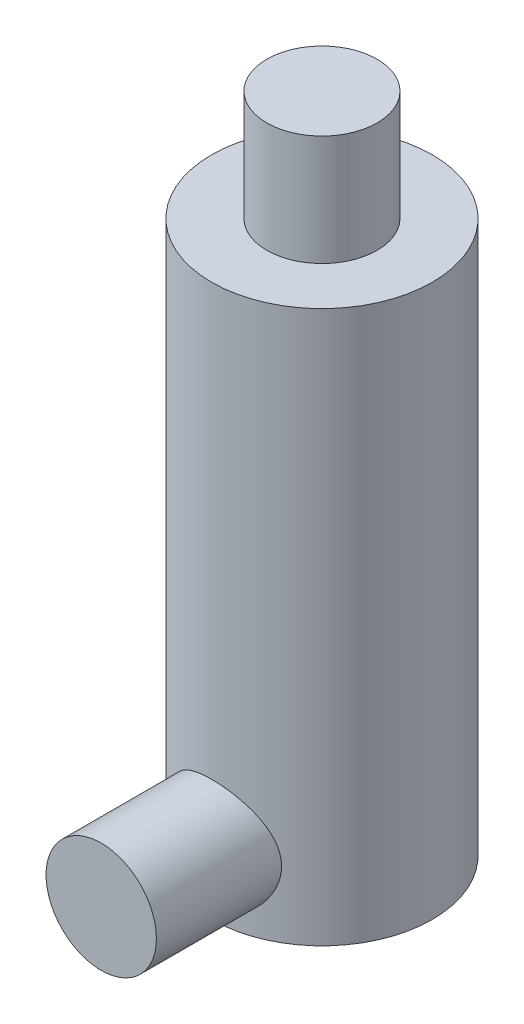
ISO-10303-21;
HEADER;
FILE_DESCRIPTION(('STEP AP214'),'2;1');
FILE_NAME('part.step','',(''),(''),'','','');
FILE_SCHEMA(('AUTOMOTIVE_DESIGN { 1 0 10303 214 1 1 1 1 }'));
ENDSEC;
DATA;
#1=APPLICATION_CONTEXT('core data for automotive mechanical design processes');
#2=APPLICATION_PROTOCOL_DEFINITION('international standard','automotive_design',2000,#1);
#3=PRODUCT_CONTEXT('',#1,'mechanical');
#4=PRODUCT('Part','Part','',(#3));
#5=PRODUCT_RELATED_PRODUCT_CATEGORY('part','',(#4));
#6=PRODUCT_DEFINITION_FORMATION('','',#4);
#7=PRODUCT_DEFINITION_CONTEXT('part definition',#1,'design');
#8=PRODUCT_DEFINITION('design','',#6,#7);
#9=PRODUCT_DEFINITION_SHAPE('','',#8);
#10=(LENGTH_UNIT() NAMED_UNIT(*) SI_UNIT(.MILLI.,.METRE.));
#11=(NAMED_UNIT(*) PLANE_ANGLE_UNIT() SI_UNIT($,.RADIAN.));
#12=(NAMED_UNIT(*) SI_UNIT($,.STERADIAN.) SOLID_ANGLE_UNIT());
#13=UNCERTAINTY_MEASURE_WITH_UNIT(LENGTH_MEASURE(1.E-05),#10,'distance_accuracy_value','');
#14=(GEOMETRIC_REPRESENTATION_CONTEXT(3) GLOBAL_UNCERTAINTY_ASSIGNED_CONTEXT((#13)) GLOBAL_UNIT_ASSIGNED_CONTEXT((#10,
#11,#12)) REPRESENTATION_CONTEXT('',''));
#15=CARTESIAN_POINT('',(0.,0.,0.));
#16=DIRECTION('',(0.,0.,1.));
#17=DIRECTION('',(1.,0.,0.));
#18=AXIS2_PLACEMENT_3D('',#15,#16,#17);
#19=CARTESIAN_POINT('',(0.,3.,10.));
#20=DIRECTION('',(0.,0.,-1.));
#21=DIRECTION('',(-1.,0.,0.));
#22=AXIS2_PLACEMENT_3D('',#19,#20,#21);
#23=CYLINDRICAL_SURFACE('',#22,2.5);
#24=CARTESIAN_POINT('',(0.,3.,10.));
#25=DIRECTION('',(0.,0.,1.));
#26=DIRECTION('',(1.,0.,0.));
#27=AXIS2_PLACEMENT_3D('',#24,#25,#26);
#28=CIRCLE('',#27,2.5);
#29=CARTESIAN_POINT('',(2.5,3.,10.));
#30=VERTEX_POINT('',#29);
#31=EDGE_CURVE('E11',#30,#30,#28,.T.);
#32=ORIENTED_EDGE('',*,*,#31,.F.);
#33=EDGE_LOOP('',(#32));
#34=FACE_BOUND('',#33,.T.);
#35=CARTESIAN_POINT('',(2.5,3.,4.33012701892219));
#36=CARTESIAN_POINT('',(2.49998948436432,3.13026650687649,4.33013982272991));
#37=CARTESIAN_POINT('',(2.48974954513168,3.26070272067625,4.33609541965583));
#38=CARTESIAN_POINT('',(2.44930840724944,3.51756897152923,4.35905877051907));
#39=CARTESIAN_POINT('',(2.41906526369545,3.64399000405729,4.37608974726023));
#40=CARTESIAN_POINT('',(2.3402497699757,3.88862894556107,4.41873376871659));
#41=CARTESIAN_POINT('',(2.29177485369963,4.00688657356221,4.44430111338921));
#42=CARTESIAN_POINT('',(2.17816884056414,4.23356056309455,4.50106659111455));
#43=CARTESIAN_POINT('',(2.11303684262671,4.34197639179579,4.53226502875883));
#44=CARTESIAN_POINT('',(1.96166634317253,4.55576430391692,4.59992173524851));
#45=CARTESIAN_POINT('',(1.87413008816917,4.66014783448977,4.63660159331577));
#46=CARTESIAN_POINT('',(1.68313452122752,4.8535209757132,4.70929956727453));
#47=CARTESIAN_POINT('',(1.57966731506051,4.94250290775495,4.74531734512768));
#48=CARTESIAN_POINT('',(1.35122390789082,5.10841787648564,4.81553692452135));
#49=CARTESIAN_POINT('',(1.22526797235894,5.18413441927914,4.84945266064072));
#50=CARTESIAN_POINT('',(0.960392566671147,5.31285213348386,4.90876890230193));
#51=CARTESIAN_POINT('',(0.821481345389983,5.3658676404385,4.93417477954535));
#52=CARTESIAN_POINT('',(0.545112359773523,5.44376165316397,4.9720115311507));
#53=CARTESIAN_POINT('',(0.408254476210983,5.47037381586513,4.98523700553425));
#54=CARTESIAN_POINT('',(0.131426571755677,5.50041529671129,5.00018959613973));
#55=CARTESIAN_POINT('',(-0.00854151460650841,5.50385864199536,5.00192366961168));
#56=CARTESIAN_POINT('',(-0.274581311061965,5.48813331506858,4.99407454791405));
#57=CARTESIAN_POINT('',(-0.400802997942673,5.47090496119545,4.98546239730476));
#58=CARTESIAN_POINT('',(-0.64828442979511,5.41779789023985,4.95935613149294));
#59=CARTESIAN_POINT('',(-0.769543802734626,5.38191777755984,4.94186135165964));
#60=CARTESIAN_POINT('',(-1.00577347892407,5.29229358477506,4.89928958219156));
#61=CARTESIAN_POINT('',(-1.120633558788,5.23830921706972,4.87411103823003));
#62=CARTESIAN_POINT('',(-1.33994200378327,5.11434145949638,4.81844114966712));
#63=CARTESIAN_POINT('',(-1.4443866220966,5.04435234174416,4.78794790393709));
#64=CARTESIAN_POINT('',(-1.6504341522455,4.88276162116743,4.72110985998074));
#65=CARTESIAN_POINT('',(-1.75083518757341,4.78974242918497,4.68448439995438));
#66=CARTESIAN_POINT('',(-1.93526092574445,4.58852568767457,4.61135851467029));
#67=CARTESIAN_POINT('',(-2.01927302893558,4.48031656931485,4.57485820664072));
#68=CARTESIAN_POINT('',(-2.17376333660553,4.24337951893978,4.50360390231212));
#69=CARTESIAN_POINT('',(-2.24304328744513,4.11378494236447,4.46910799976769));
#70=CARTESIAN_POINT('',(-2.35829778250308,3.84265582160251,4.40938625696439));
#71=CARTESIAN_POINT('',(-2.40429664552722,3.70113391745609,4.38415075115168));
#72=CARTESIAN_POINT('',(-2.4679505275626,3.42196372179303,4.34861589542586));
#73=CARTESIAN_POINT('',(-2.48756280529994,3.28489720239113,4.33729139621241));
#74=CARTESIAN_POINT('',(-2.50379236652857,3.00899664620864,4.32794798404024));
#75=CARTESIAN_POINT('',(-2.50042589328757,2.8701639272005,4.32991967223279));
#76=CARTESIAN_POINT('',(-2.47259010835991,2.6108652035532,4.34585841351462));
#77=CARTESIAN_POINT('',(-2.45046954178116,2.49005137223027,4.35848968766635));
#78=CARTESIAN_POINT('',(-2.38924071158112,2.25408053432252,4.39235053878353));
#79=CARTESIAN_POINT('',(-2.35012694655908,2.13892537313315,4.41358290012585));
#80=CARTESIAN_POINT('',(-2.25411897151217,1.91147167274361,4.46340555199141));
#81=CARTESIAN_POINT('',(-2.19648515923162,1.79955245786744,4.49229108107657));
#82=CARTESIAN_POINT('',(-2.0657176600397,1.5863268211512,4.55390298743125));
#83=CARTESIAN_POINT('',(-1.99257601083123,1.48502589121186,4.58663133387872));
#84=CARTESIAN_POINT('',(-1.82209291799636,1.28255308119668,4.65719996140836));
#85=CARTESIAN_POINT('',(-1.72286318078435,1.18300712322778,4.69516457885708));
#86=CARTESIAN_POINT('',(-1.5085112384988,1.00146940499409,4.76835587444746));
#87=CARTESIAN_POINT('',(-1.39338368664988,0.919483574341452,4.80358162519329));
#88=CARTESIAN_POINT('',(-1.14633840638507,0.773565685209113,4.86853404227334));
#89=CARTESIAN_POINT('',(-1.01405774389062,0.71016720479154,4.89809104179855));
#90=CARTESIAN_POINT('',(-0.738805911647332,0.607155240037983,4.9470838739847));
#91=CARTESIAN_POINT('',(-0.595844253647067,0.567520870394878,4.96652859191746));
#92=CARTESIAN_POINT('',(-0.317449205674706,0.516578590643578,4.99168770453968));
#93=CARTESIAN_POINT('',(-0.182528609085376,0.503005314169655,4.99849819767838));
#94=CARTESIAN_POINT('',(0.0878149643374308,0.497891832505408,5.00105325940467));
#95=CARTESIAN_POINT('',(0.223237748727016,0.506343914338916,4.99680170177041));
#96=CARTESIAN_POINT('',(0.481344982671073,0.543541030395506,4.97834922085637));
#97=CARTESIAN_POINT('',(0.604280801321773,0.570912171636315,4.96482236636807));
#98=CARTESIAN_POINT('',(0.843614873664455,0.643317449758332,4.92980234191731));
#99=CARTESIAN_POINT('',(0.960012187087214,0.688354119633634,4.90830802955518));
#100=CARTESIAN_POINT('',(1.18855854199593,0.79681781873926,4.85814826741488));
#101=CARTESIAN_POINT('',(1.30031295715363,0.860949024689846,4.82921542506803));
#102=CARTESIAN_POINT('',(1.51193650408535,1.00489411014759,4.76720333344986));
#103=CARTESIAN_POINT('',(1.61180014305397,1.08471519262687,4.73412218229104));
#104=CARTESIAN_POINT('',(1.8072854232437,1.26699579444936,4.66321523550925));
#105=CARTESIAN_POINT('',(1.90149582349002,1.37091772600073,4.62524489658366));
#106=CARTESIAN_POINT('',(2.07165660492503,1.59361528538223,4.55157698284941));
#107=CARTESIAN_POINT('',(2.1475908315154,1.71240391419923,4.51588143910584));
#108=CARTESIAN_POINT('',(2.28108393396028,1.96663611766426,4.44998982823926));
#109=CARTESIAN_POINT('',(2.3379862797745,2.1024873884246,4.42000320346984));
#110=CARTESIAN_POINT('',(2.40494911880459,2.31322264951977,4.38370272660093));
#111=CARTESIAN_POINT('',(2.42419582683991,2.38455977569761,4.37305486646054));
#112=CARTESIAN_POINT('',(2.45635087255789,2.52904069684933,4.35507574170935));
#113=CARTESIAN_POINT('',(2.46926364179176,2.60218319095442,4.34774215854234));
#114=CARTESIAN_POINT('',(2.48591166201423,2.72950098654694,4.3382377954292));
#115=CARTESIAN_POINT('',(2.49118864979202,2.78341632151221,4.33520487024791));
#116=CARTESIAN_POINT('',(2.49823512543934,2.89154461631041,4.33114674911323));
#117=CARTESIAN_POINT('',(2.50000437866474,2.94575759581055,4.33012168747261));
#118=CARTESIAN_POINT('',(2.5,3.,4.33012701892219));
#119=B_SPLINE_CURVE_WITH_KNOTS('',3,(#35,#36,#37,#38,#39,#40,#41,#42,#43,#44,#45,#46,#47,#48,
#49,#50,#51,#52,#53,#54,#55,#56,#57,#58,#59,#60,#61,#62,#63,#64,#65,#66,#67,#68,#69,#70,#71,#72,
#73,#74,#75,#76,#77,#78,#79,#80,#81,#82,#83,#84,#85,#86,#87,#88,#89,#90,#91,#92,#93,#94,#95,#96,
#97,#98,#99,#100,#101,#102,#103,#104,#105,#106,#107,#108,#109,#110,#111,#112,#113,#114,#115,
#116,#117,#118),.UNSPECIFIED.,.T.,.F.,(4,2,2,2,2,2,2,2,2,2,2,2,2,2,2,2,2,2,2,2,2,2,2,2,2,2,2,2,
2,2,2,2,2,2,2,2,2,2,2,2,2,4),(0.,0.390580306486789,0.781982232062012,1.17132148982692,
1.56068181366371,1.98215578129642,2.40383927716011,2.85394730601992,3.30377067414811,
3.72158712424921,4.13915059220183,4.52040243716429,4.90168281298721,5.2882383683295,
5.67493248380763,6.0981797864731,6.5217512061988,6.97222104328704,7.42221935534346,
7.83655727140613,8.25060232976016,8.61935458565147,8.98822631095241,9.37418241020302,
9.76033715555202,10.1951685895662,10.6301466245059,11.076604535375,11.5226694952701,
11.927806759788,12.3328021699001,12.7111106218381,13.0894733378512,13.4840187680376,
13.8787457525688,14.3127560463025,14.7471485711797,15.195268726016,15.4189244153949,
15.6424233996907,15.8050484542806,15.9676843870379),.UNSPECIFIED.);
#120=CARTESIAN_POINT('',(2.5,3.,4.33012701892219));
#121=VERTEX_POINT('',#120);
#122=EDGE_CURVE('E51',#121,#121,#119,.T.);
#123=ORIENTED_EDGE('',*,*,#122,.T.);
#124=EDGE_LOOP('',(#123));
#125=FACE_BOUND('',#124,.T.);
#126=ADVANCED_FACE('F45',(#34,#125),#23,.T.);
#127=CARTESIAN_POINT('',(0.,3.,10.));
#128=DIRECTION('',(0.,0.,1.));
#129=DIRECTION('',(1.,0.,0.));
#130=AXIS2_PLACEMENT_3D('',#127,#128,#129);
#131=PLANE('',#130);
#132=ORIENTED_EDGE('',*,*,#31,.T.);
#133=EDGE_LOOP('',(#132));
#134=FACE_BOUND('',#133,.T.);
#135=ADVANCED_FACE('F66',(#134),#131,.T.);
#136=CARTESIAN_POINT('',(0.,25.,0.));
#137=DIRECTION('',(0.,-1.,0.));
#138=DIRECTION('',(0.,0.,-1.));
#139=AXIS2_PLACEMENT_3D('',#136,#137,#138);
#140=CYLINDRICAL_SURFACE('',#139,5.);
#141=ORIENTED_EDGE('',*,*,#122,.F.);
#142=EDGE_LOOP('',(#141));
#143=FACE_BOUND('',#142,.T.);
#144=ADVANCED_FACE('F63',(#143),#140,.F.);
#145=CLOSED_SHELL('',(#126,#135,#144));
#146=MANIFOLD_SOLID_BREP('B2',#145);
#147=CARTESIAN_POINT('',(0.,25.,0.));
#148=DIRECTION('',(0.,-1.,0.));
#149=DIRECTION('',(0.,0.,-1.));
#150=AXIS2_PLACEMENT_3D('',#147,#148,#149);
#151=CYLINDRICAL_SURFACE('',#150,5.);
#152=CARTESIAN_POINT('',(0.,25.,0.));
#153=DIRECTION('',(0.,1.,0.));
#154=DIRECTION('',(0.,0.,1.));
#155=AXIS2_PLACEMENT_3D('',#152,#153,#154);
#156=CIRCLE('',#155,5.);
#157=CARTESIAN_POINT('',(0.,25.,5.));
#158=VERTEX_POINT('',#157);
#159=EDGE_CURVE('E103',#158,#158,#156,.T.);
#160=ORIENTED_EDGE('',*,*,#159,.F.);
#161=EDGE_LOOP('',(#160));
#162=FACE_BOUND('',#161,.T.);
#163=CARTESIAN_POINT('',(0.,0.,0.));
#164=DIRECTION('',(0.,1.,0.));
#165=DIRECTION('',(0.,0.,1.));
#166=AXIS2_PLACEMENT_3D('',#163,#164,#165);
#167=CIRCLE('',#166,5.);
#168=CARTESIAN_POINT('',(0.,0.,5.));
#169=VERTEX_POINT('',#168);
#170=EDGE_CURVE('E98',#169,#169,#167,.T.);
#171=ORIENTED_EDGE('',*,*,#170,.T.);
#172=EDGE_LOOP('',(#171));
#173=FACE_BOUND('',#172,.T.);
#174=ADVANCED_FACE('F95',(#162,#173),#151,.T.);
#175=CARTESIAN_POINT('',(0.,25.,0.));
#176=DIRECTION('',(0.,1.,0.));
#177=DIRECTION('',(0.,0.,1.));
#178=AXIS2_PLACEMENT_3D('',#175,#176,#177);
#179=PLANE('',#178);
#180=CARTESIAN_POINT('',(0.,25.,0.));
#181=DIRECTION('',(0.,1.,0.));
#182=DIRECTION('',(0.,0.,1.));
#183=AXIS2_PLACEMENT_3D('',#180,#181,#182);
#184=CIRCLE('',#183,2.5);
#185=CARTESIAN_POINT('',(0.,25.,2.5));
#186=VERTEX_POINT('',#185);
#187=EDGE_CURVE('E44',#186,#186,#184,.T.);
#188=ORIENTED_EDGE('',*,*,#187,.F.);
#189=EDGE_LOOP('',(#188));
#190=FACE_BOUND('',#189,.T.);
#191=ORIENTED_EDGE('',*,*,#159,.T.);
#192=EDGE_LOOP('',(#191));
#193=FACE_BOUND('',#192,.T.);
#194=ADVANCED_FACE('F123',(#190,#193),#179,.T.);
#195=CARTESIAN_POINT('',(0.,0.,0.));
#196=DIRECTION('',(0.,1.,0.));
#197=DIRECTION('',(0.,0.,1.));
#198=AXIS2_PLACEMENT_3D('',#195,#196,#197);
#199=PLANE('',#198);
#200=ORIENTED_EDGE('',*,*,#170,.F.);
#201=EDGE_LOOP('',(#200));
#202=FACE_BOUND('',#201,.T.);
#203=ADVANCED_FACE('F120',(#202),#199,.F.);
#204=CARTESIAN_POINT('',(0.,30.,0.));
#205=DIRECTION('',(0.,-1.,0.));
#206=DIRECTION('',(0.,0.,-1.));
#207=AXIS2_PLACEMENT_3D('',#204,#205,#206);
#208=CYLINDRICAL_SURFACE('',#207,2.5);
#209=CARTESIAN_POINT('',(0.,30.,0.));
#210=DIRECTION('',(0.,1.,0.));
#211=DIRECTION('',(0.,0.,1.));
#212=AXIS2_PLACEMENT_3D('',#209,#210,#211);
#213=CIRCLE('',#212,2.5);
#214=CARTESIAN_POINT('',(0.,30.,2.5));
#215=VERTEX_POINT('',#214);
#216=EDGE_CURVE('E110',#215,#215,#213,.T.);
#217=ORIENTED_EDGE('',*,*,#216,.F.);
#218=EDGE_LOOP('',(#217));
#219=FACE_BOUND('',#218,.T.);
#220=ORIENTED_EDGE('',*,*,#187,.T.);
#221=EDGE_LOOP('',(#220));
#222=FACE_BOUND('',#221,.T.);
#223=ADVANCED_FACE('F122',(#219,#222),#208,.T.);
#224=CARTESIAN_POINT('',(0.,30.,0.));
#225=DIRECTION('',(0.,1.,0.));
#226=DIRECTION('',(0.,0.,1.));
#227=AXIS2_PLACEMENT_3D('',#224,#225,#226);
#228=PLANE('',#227);
#229=ORIENTED_EDGE('',*,*,#216,.T.);
#230=EDGE_LOOP('',(#229));
#231=FACE_BOUND('',#230,.T.);
#232=ADVANCED_FACE('F128',(#231),#228,.T.);
#233=CLOSED_SHELL('',(#174,#194,#203,#223,#232));
#234=MANIFOLD_SOLID_BREP('B6',#233);
#235=ADVANCED_BREP_SHAPE_REPRESENTATION('',(#18,#146,#234),#14);
#236=SHAPE_DEFINITION_REPRESENTATION(#9,#235);
ENDSEC;
END-ISO-10303-21;
